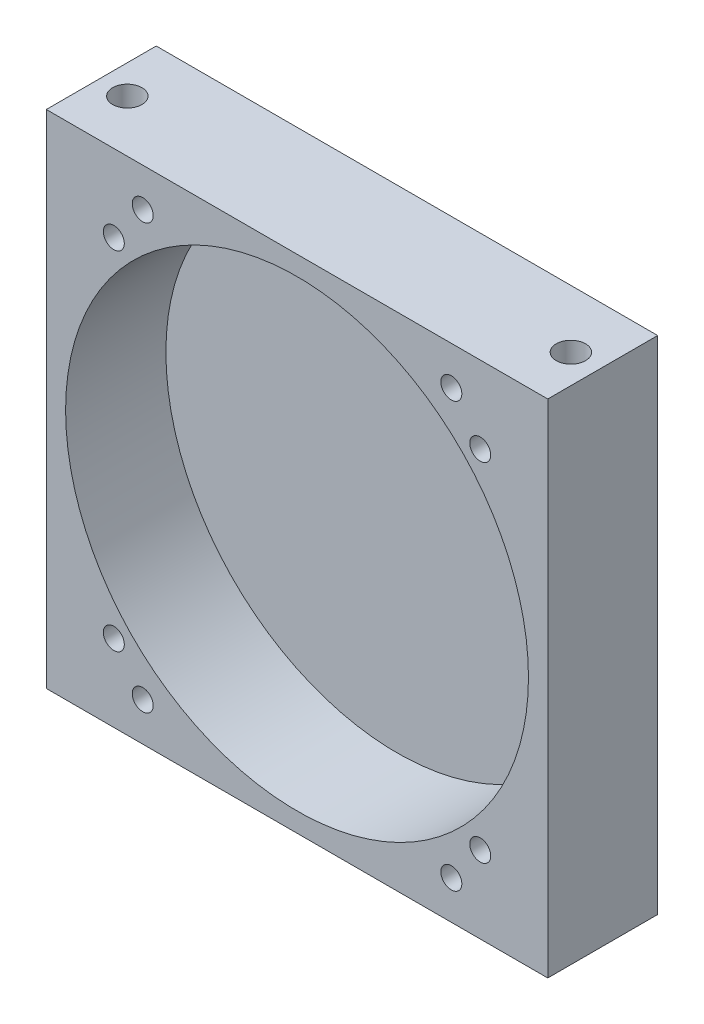
ISO-10303-21;
HEADER;
FILE_DESCRIPTION(('STEP AP214'),'2;1');
FILE_NAME('part.step','',(''),(''),'','','');
FILE_SCHEMA(('AUTOMOTIVE_DESIGN { 1 0 10303 214 1 1 1 1 }'));
ENDSEC;
DATA;
#1=APPLICATION_CONTEXT('core data for automotive mechanical design processes');
#2=APPLICATION_PROTOCOL_DEFINITION('international standard','automotive_design',2000,#1);
#3=PRODUCT_CONTEXT('',#1,'mechanical');
#4=PRODUCT('Part','Part','',(#3));
#5=PRODUCT_RELATED_PRODUCT_CATEGORY('part','',(#4));
#6=PRODUCT_DEFINITION_FORMATION('','',#4);
#7=PRODUCT_DEFINITION_CONTEXT('part definition',#1,'design');
#8=PRODUCT_DEFINITION('design','',#6,#7);
#9=PRODUCT_DEFINITION_SHAPE('','',#8);
#10=(LENGTH_UNIT() NAMED_UNIT(*) SI_UNIT(.MILLI.,.METRE.));
#11=(NAMED_UNIT(*) PLANE_ANGLE_UNIT() SI_UNIT($,.RADIAN.));
#12=(NAMED_UNIT(*) SI_UNIT($,.STERADIAN.) SOLID_ANGLE_UNIT());
#13=UNCERTAINTY_MEASURE_WITH_UNIT(LENGTH_MEASURE(1.E-05),#10,'distance_accuracy_value','');
#14=(GEOMETRIC_REPRESENTATION_CONTEXT(3) GLOBAL_UNCERTAINTY_ASSIGNED_CONTEXT((#13)) GLOBAL_UNIT_ASSIGNED_CONTEXT((#10,
#11,#12)) REPRESENTATION_CONTEXT('',''));
#15=CARTESIAN_POINT('',(0.,0.,0.));
#16=DIRECTION('',(0.,0.,1.));
#17=DIRECTION('',(1.,0.,0.));
#18=AXIS2_PLACEMENT_3D('',#15,#16,#17);
#19=CARTESIAN_POINT('',(-41.275,-41.275,18.0975));
#20=DIRECTION('',(1.,0.,0.));
#21=DIRECTION('',(0.,0.,-1.));
#22=AXIS2_PLACEMENT_3D('',#19,#20,#21);
#23=PLANE('',#22);
#24=DIRECTION('',(0.,-1.,0.));
#25=VECTOR('',#24,1.);
#26=CARTESIAN_POINT('',(-41.275,-41.275,0.));
#27=LINE('',#26,#25);
#28=CARTESIAN_POINT('',(-41.275,41.275,0.));
#29=VERTEX_POINT('',#28);
#30=CARTESIAN_POINT('',(-41.275,-41.275,0.));
#31=VERTEX_POINT('',#30);
#32=EDGE_CURVE('E236',#29,#31,#27,.T.);
#33=ORIENTED_EDGE('',*,*,#32,.T.);
#34=DIRECTION('',(0.,0.,-1.));
#35=VECTOR('',#34,1.);
#36=CARTESIAN_POINT('',(-41.275,-41.275,18.0975));
#37=LINE('',#36,#35);
#38=CARTESIAN_POINT('',(-41.275,-41.275,18.0975));
#39=VERTEX_POINT('',#38);
#40=EDGE_CURVE('E11',#39,#31,#37,.T.);
#41=ORIENTED_EDGE('',*,*,#40,.F.);
#42=DIRECTION('',(0.,-1.,0.));
#43=VECTOR('',#42,1.);
#44=CARTESIAN_POINT('',(-41.275,-41.275,18.0975));
#45=LINE('',#44,#43);
#46=CARTESIAN_POINT('',(-41.275,41.275,18.0975));
#47=VERTEX_POINT('',#46);
#48=EDGE_CURVE('E239',#47,#39,#45,.T.);
#49=ORIENTED_EDGE('',*,*,#48,.F.);
#50=DIRECTION('',(0.,0.,-1.));
#51=VECTOR('',#50,1.);
#52=CARTESIAN_POINT('',(-41.275,41.275,18.0975));
#53=LINE('',#52,#51);
#54=EDGE_CURVE('E245',#47,#29,#53,.T.);
#55=ORIENTED_EDGE('',*,*,#54,.T.);
#56=EDGE_LOOP('',(#33,#41,#49,#55));
#57=FACE_BOUND('',#56,.T.);
#58=ADVANCED_FACE('F43',(#57),#23,.F.);
#59=CARTESIAN_POINT('',(41.275,-41.275,18.0975));
#60=DIRECTION('',(0.,1.,0.));
#61=DIRECTION('',(-1.,0.,0.));
#62=AXIS2_PLACEMENT_3D('',#59,#60,#61);
#63=PLANE('',#62);
#64=CARTESIAN_POINT('',(-36.5125,-41.275,9.525));
#65=DIRECTION('',(0.,-1.,0.));
#66=DIRECTION('',(0.,0.,-1.));
#67=AXIS2_PLACEMENT_3D('',#64,#65,#66);
#68=CIRCLE('',#67,2.413);
#69=CARTESIAN_POINT('',(-36.5125,-41.275,7.112));
#70=VERTEX_POINT('',#69);
#71=EDGE_CURVE('E184',#70,#70,#68,.T.);
#72=ORIENTED_EDGE('',*,*,#71,.F.);
#73=EDGE_LOOP('',(#72));
#74=FACE_BOUND('',#73,.T.);
#75=CARTESIAN_POINT('',(36.5125,-41.275,9.525));
#76=DIRECTION('',(0.,-1.,0.));
#77=DIRECTION('',(0.,0.,-1.));
#78=AXIS2_PLACEMENT_3D('',#75,#76,#77);
#79=CIRCLE('',#78,2.413);
#80=CARTESIAN_POINT('',(36.5125,-41.275,7.112));
#81=VERTEX_POINT('',#80);
#82=EDGE_CURVE('E196',#81,#81,#79,.T.);
#83=ORIENTED_EDGE('',*,*,#82,.F.);
#84=EDGE_LOOP('',(#83));
#85=FACE_BOUND('',#84,.T.);
#86=DIRECTION('',(1.,0.,0.));
#87=VECTOR('',#86,1.);
#88=CARTESIAN_POINT('',(41.275,-41.275,0.));
#89=LINE('',#88,#87);
#90=CARTESIAN_POINT('',(41.275,-41.275,0.));
#91=VERTEX_POINT('',#90);
#92=EDGE_CURVE('E248',#31,#91,#89,.T.);
#93=ORIENTED_EDGE('',*,*,#92,.T.);
#94=DIRECTION('',(0.,0.,-1.));
#95=VECTOR('',#94,1.);
#96=CARTESIAN_POINT('',(41.275,-41.275,18.0975));
#97=LINE('',#96,#95);
#98=CARTESIAN_POINT('',(41.275,-41.275,18.0975));
#99=VERTEX_POINT('',#98);
#100=EDGE_CURVE('E51',#99,#91,#97,.T.);
#101=ORIENTED_EDGE('',*,*,#100,.F.);
#102=DIRECTION('',(1.,0.,0.));
#103=VECTOR('',#102,1.);
#104=CARTESIAN_POINT('',(41.275,-41.275,18.0975));
#105=LINE('',#104,#103);
#106=EDGE_CURVE('E90',#39,#99,#105,.T.);
#107=ORIENTED_EDGE('',*,*,#106,.F.);
#108=ORIENTED_EDGE('',*,*,#40,.T.);
#109=EDGE_LOOP('',(#93,#101,#107,#108));
#110=FACE_BOUND('',#109,.T.);
#111=ADVANCED_FACE('F273',(#74,#85,#110),#63,.F.);
#112=CARTESIAN_POINT('',(41.275,-41.275,18.0975));
#113=DIRECTION('',(-1.,0.,0.));
#114=DIRECTION('',(0.,0.,1.));
#115=AXIS2_PLACEMENT_3D('',#112,#113,#114);
#116=PLANE('',#115);
#117=DIRECTION('',(0.,1.,0.));
#118=VECTOR('',#117,1.);
#119=CARTESIAN_POINT('',(41.275,-41.275,0.));
#120=LINE('',#119,#118);
#121=CARTESIAN_POINT('',(41.275,41.275,0.));
#122=VERTEX_POINT('',#121);
#123=EDGE_CURVE('E77',#91,#122,#120,.T.);
#124=ORIENTED_EDGE('',*,*,#123,.T.);
#125=DIRECTION('',(0.,0.,-1.));
#126=VECTOR('',#125,1.);
#127=CARTESIAN_POINT('',(41.275,41.275,18.0975));
#128=LINE('',#127,#126);
#129=CARTESIAN_POINT('',(41.275,41.275,18.0975));
#130=VERTEX_POINT('',#129);
#131=EDGE_CURVE('E253',#130,#122,#128,.T.);
#132=ORIENTED_EDGE('',*,*,#131,.F.);
#133=DIRECTION('',(0.,1.,0.));
#134=VECTOR('',#133,1.);
#135=CARTESIAN_POINT('',(41.275,-41.275,18.0975));
#136=LINE('',#135,#134);
#137=EDGE_CURVE('E242',#99,#130,#136,.T.);
#138=ORIENTED_EDGE('',*,*,#137,.F.);
#139=ORIENTED_EDGE('',*,*,#100,.T.);
#140=EDGE_LOOP('',(#124,#132,#138,#139));
#141=FACE_BOUND('',#140,.T.);
#142=ADVANCED_FACE('F255',(#141),#116,.F.);
#143=CARTESIAN_POINT('',(41.275,41.275,18.0975));
#144=DIRECTION('',(0.,-1.,0.));
#145=DIRECTION('',(1.,0.,0.));
#146=AXIS2_PLACEMENT_3D('',#143,#144,#145);
#147=PLANE('',#146);
#148=CARTESIAN_POINT('',(-36.5125,41.275,9.525));
#149=DIRECTION('',(0.,1.,0.));
#150=DIRECTION('',(0.,0.,1.));
#151=AXIS2_PLACEMENT_3D('',#148,#149,#150);
#152=CIRCLE('',#151,2.413);
#153=CARTESIAN_POINT('',(-36.5125,41.275,11.938));
#154=VERTEX_POINT('',#153);
#155=EDGE_CURVE('E208',#154,#154,#152,.T.);
#156=ORIENTED_EDGE('',*,*,#155,.F.);
#157=EDGE_LOOP('',(#156));
#158=FACE_BOUND('',#157,.T.);
#159=CARTESIAN_POINT('',(36.5125,41.275,9.525));
#160=DIRECTION('',(0.,1.,0.));
#161=DIRECTION('',(0.,0.,1.));
#162=AXIS2_PLACEMENT_3D('',#159,#160,#161);
#163=CIRCLE('',#162,2.413);
#164=CARTESIAN_POINT('',(36.5125,41.275,11.938));
#165=VERTEX_POINT('',#164);
#166=EDGE_CURVE('E220',#165,#165,#163,.T.);
#167=ORIENTED_EDGE('',*,*,#166,.F.);
#168=EDGE_LOOP('',(#167));
#169=FACE_BOUND('',#168,.T.);
#170=DIRECTION('',(-1.,0.,0.));
#171=VECTOR('',#170,1.);
#172=CARTESIAN_POINT('',(41.275,41.275,0.));
#173=LINE('',#172,#171);
#174=EDGE_CURVE('E83',#122,#29,#173,.T.);
#175=ORIENTED_EDGE('',*,*,#174,.T.);
#176=ORIENTED_EDGE('',*,*,#54,.F.);
#177=DIRECTION('',(-1.,0.,0.));
#178=VECTOR('',#177,1.);
#179=CARTESIAN_POINT('',(41.275,41.275,18.0975));
#180=LINE('',#179,#178);
#181=EDGE_CURVE('E59',#130,#47,#180,.T.);
#182=ORIENTED_EDGE('',*,*,#181,.F.);
#183=ORIENTED_EDGE('',*,*,#131,.T.);
#184=EDGE_LOOP('',(#175,#176,#182,#183));
#185=FACE_BOUND('',#184,.T.);
#186=ADVANCED_FACE('F262',(#158,#169,#185),#147,.F.);
#187=CARTESIAN_POINT('',(-41.275,41.275,18.0975));
#188=DIRECTION('',(0.,0.,1.));
#189=DIRECTION('',(1.,0.,0.));
#190=AXIS2_PLACEMENT_3D('',#187,#188,#189);
#191=PLANE('',#190);
#192=CARTESIAN_POINT('',(30.1625,-28.575,18.0975));
#193=DIRECTION('',(0.,0.,1.));
#194=DIRECTION('',(1.,0.,0.));
#195=AXIS2_PLACEMENT_3D('',#192,#193,#194);
#196=CIRCLE('',#195,1.72719999999999);
#197=CARTESIAN_POINT('',(31.8897,-28.575,18.0975));
#198=VERTEX_POINT('',#197);
#199=EDGE_CURVE('E138',#198,#198,#196,.T.);
#200=ORIENTED_EDGE('',*,*,#199,.F.);
#201=EDGE_LOOP('',(#200));
#202=FACE_BOUND('',#201,.T.);
#203=CARTESIAN_POINT('',(-30.1625,28.575,18.0975));
#204=DIRECTION('',(0.,0.,1.));
#205=DIRECTION('',(1.,0.,0.));
#206=AXIS2_PLACEMENT_3D('',#203,#204,#205);
#207=CIRCLE('',#206,1.72719999999999);
#208=CARTESIAN_POINT('',(-28.4353,28.575,18.0975));
#209=VERTEX_POINT('',#208);
#210=EDGE_CURVE('E137',#209,#209,#207,.T.);
#211=ORIENTED_EDGE('',*,*,#210,.F.);
#212=EDGE_LOOP('',(#211));
#213=FACE_BOUND('',#212,.T.);
#214=CARTESIAN_POINT('',(-30.1625,-28.575,18.0975));
#215=DIRECTION('',(0.,0.,1.));
#216=DIRECTION('',(1.,0.,0.));
#217=AXIS2_PLACEMENT_3D('',#214,#215,#216);
#218=CIRCLE('',#217,1.72719999999999);
#219=CARTESIAN_POINT('',(-28.4353,-28.575,18.0975));
#220=VERTEX_POINT('',#219);
#221=EDGE_CURVE('E148',#220,#220,#218,.T.);
#222=ORIENTED_EDGE('',*,*,#221,.F.);
#223=EDGE_LOOP('',(#222));
#224=FACE_BOUND('',#223,.T.);
#225=CARTESIAN_POINT('',(30.1625,28.575,18.0975));
#226=DIRECTION('',(0.,0.,1.));
#227=DIRECTION('',(1.,0.,0.));
#228=AXIS2_PLACEMENT_3D('',#225,#226,#227);
#229=CIRCLE('',#228,1.72719999999999);
#230=CARTESIAN_POINT('',(31.8897,28.575,18.0975));
#231=VERTEX_POINT('',#230);
#232=EDGE_CURVE('E154',#231,#231,#229,.T.);
#233=ORIENTED_EDGE('',*,*,#232,.F.);
#234=EDGE_LOOP('',(#233));
#235=FACE_BOUND('',#234,.T.);
#236=CARTESIAN_POINT('',(25.4,-34.925,18.0975));
#237=DIRECTION('',(0.,0.,1.));
#238=DIRECTION('',(1.,0.,0.));
#239=AXIS2_PLACEMENT_3D('',#236,#237,#238);
#240=CIRCLE('',#239,1.72719999999999);
#241=CARTESIAN_POINT('',(27.1272,-34.925,18.0975));
#242=VERTEX_POINT('',#241);
#243=EDGE_CURVE('E160',#242,#242,#240,.T.);
#244=ORIENTED_EDGE('',*,*,#243,.F.);
#245=EDGE_LOOP('',(#244));
#246=FACE_BOUND('',#245,.T.);
#247=CARTESIAN_POINT('',(-25.4,-34.925,18.0975));
#248=DIRECTION('',(0.,0.,1.));
#249=DIRECTION('',(1.,0.,0.));
#250=AXIS2_PLACEMENT_3D('',#247,#248,#249);
#251=CIRCLE('',#250,1.72719999999999);
#252=CARTESIAN_POINT('',(-23.6728,-34.925,18.0975));
#253=VERTEX_POINT('',#252);
#254=EDGE_CURVE('E166',#253,#253,#251,.T.);
#255=ORIENTED_EDGE('',*,*,#254,.F.);
#256=EDGE_LOOP('',(#255));
#257=FACE_BOUND('',#256,.T.);
#258=CARTESIAN_POINT('',(-25.4,34.925,18.0975));
#259=DIRECTION('',(0.,0.,1.));
#260=DIRECTION('',(1.,0.,0.));
#261=AXIS2_PLACEMENT_3D('',#258,#259,#260);
#262=CIRCLE('',#261,1.72719999999999);
#263=CARTESIAN_POINT('',(-23.6728,34.925,18.0975));
#264=VERTEX_POINT('',#263);
#265=EDGE_CURVE('E172',#264,#264,#262,.T.);
#266=ORIENTED_EDGE('',*,*,#265,.F.);
#267=EDGE_LOOP('',(#266));
#268=FACE_BOUND('',#267,.T.);
#269=CARTESIAN_POINT('',(25.4,34.925,18.0975));
#270=DIRECTION('',(0.,0.,1.));
#271=DIRECTION('',(1.,0.,0.));
#272=AXIS2_PLACEMENT_3D('',#269,#270,#271);
#273=CIRCLE('',#272,1.72719999999999);
#274=CARTESIAN_POINT('',(27.1272,34.925,18.0975));
#275=VERTEX_POINT('',#274);
#276=EDGE_CURVE('E178',#275,#275,#273,.T.);
#277=ORIENTED_EDGE('',*,*,#276,.F.);
#278=EDGE_LOOP('',(#277));
#279=FACE_BOUND('',#278,.T.);
#280=CARTESIAN_POINT('',(0.,0.,18.0975));
#281=DIRECTION('',(0.,0.,1.));
#282=DIRECTION('',(1.,0.,0.));
#283=AXIS2_PLACEMENT_3D('',#280,#281,#282);
#284=CIRCLE('',#283,38.1);
#285=CARTESIAN_POINT('',(38.1,0.,18.0975));
#286=VERTEX_POINT('',#285);
#287=EDGE_CURVE('E232',#286,#286,#284,.T.);
#288=ORIENTED_EDGE('',*,*,#287,.F.);
#289=EDGE_LOOP('',(#288));
#290=FACE_BOUND('',#289,.T.);
#291=ORIENTED_EDGE('',*,*,#48,.T.);
#292=ORIENTED_EDGE('',*,*,#106,.T.);
#293=ORIENTED_EDGE('',*,*,#137,.T.);
#294=ORIENTED_EDGE('',*,*,#181,.T.);
#295=EDGE_LOOP('',(#291,#292,#293,#294));
#296=FACE_BOUND('',#295,.T.);
#297=ADVANCED_FACE('F264',(#202,#213,#224,#235,#246,#257,#268,#279,#290,#296),#191,.T.);
#298=CARTESIAN_POINT('',(-41.275,41.275,0.));
#299=DIRECTION('',(0.,0.,1.));
#300=DIRECTION('',(1.,0.,0.));
#301=AXIS2_PLACEMENT_3D('',#298,#299,#300);
#302=PLANE('',#301);
#303=ORIENTED_EDGE('',*,*,#32,.F.);
#304=ORIENTED_EDGE('',*,*,#174,.F.);
#305=ORIENTED_EDGE('',*,*,#123,.F.);
#306=ORIENTED_EDGE('',*,*,#92,.F.);
#307=EDGE_LOOP('',(#303,#304,#305,#306));
#308=FACE_BOUND('',#307,.T.);
#309=ADVANCED_FACE('F258',(#308),#302,.F.);
#310=CARTESIAN_POINT('',(0.,0.,1.5875));
#311=DIRECTION('',(0.,0.,1.));
#312=DIRECTION('',(1.,0.,0.));
#313=AXIS2_PLACEMENT_3D('',#310,#311,#312);
#314=CYLINDRICAL_SURFACE('',#313,38.1);
#315=CARTESIAN_POINT('',(0.,0.,1.5875));
#316=DIRECTION('',(0.,0.,1.));
#317=DIRECTION('',(1.,0.,0.));
#318=AXIS2_PLACEMENT_3D('',#315,#316,#317);
#319=CIRCLE('',#318,38.1);
#320=CARTESIAN_POINT('',(38.1,0.,1.5875));
#321=VERTEX_POINT('',#320);
#322=EDGE_CURVE('E233',#321,#321,#319,.T.);
#323=ORIENTED_EDGE('',*,*,#322,.F.);
#324=EDGE_LOOP('',(#323));
#325=FACE_BOUND('',#324,.T.);
#326=ORIENTED_EDGE('',*,*,#287,.T.);
#327=EDGE_LOOP('',(#326));
#328=FACE_BOUND('',#327,.T.);
#329=ADVANCED_FACE('F350',(#325,#328),#314,.F.);
#330=CARTESIAN_POINT('',(0.,0.,1.5875));
#331=DIRECTION('',(0.,0.,1.));
#332=DIRECTION('',(1.,0.,0.));
#333=AXIS2_PLACEMENT_3D('',#330,#331,#332);
#334=PLANE('',#333);
#335=ORIENTED_EDGE('',*,*,#322,.T.);
#336=EDGE_LOOP('',(#335));
#337=FACE_BOUND('',#336,.T.);
#338=ADVANCED_FACE('F346',(#337),#334,.T.);
#339=CARTESIAN_POINT('',(36.5125,22.225,9.525));
#340=DIRECTION('',(0.,1.,0.));
#341=DIRECTION('',(0.,0.,1.));
#342=AXIS2_PLACEMENT_3D('',#339,#340,#341);
#343=CONICAL_SURFACE('',#342,2.01929999999999,1.02974425867665);
#344=CARTESIAN_POINT('',(36.5125,21.0116821519976,9.525));
#345=VERTEX_POINT('',#344);
#346=VERTEX_LOOP('',#345);
#347=FACE_BOUND('',#346,.T.);
#348=CARTESIAN_POINT('',(36.5125,22.225,9.525));
#349=DIRECTION('',(0.,1.,0.));
#350=DIRECTION('',(0.,0.,1.));
#351=AXIS2_PLACEMENT_3D('',#348,#349,#350);
#352=CIRCLE('',#351,2.01929999999999);
#353=CARTESIAN_POINT('',(36.5125,22.225,11.5443));
#354=VERTEX_POINT('',#353);
#355=EDGE_CURVE('E229',#354,#354,#352,.T.);
#356=ORIENTED_EDGE('',*,*,#355,.T.);
#357=EDGE_LOOP('',(#356));
#358=FACE_BOUND('',#357,.T.);
#359=ADVANCED_FACE('F342',(#347,#358),#343,.F.);
#360=CARTESIAN_POINT('',(36.5125,41.275,9.525));
#361=DIRECTION('',(0.,1.,0.));
#362=DIRECTION('',(0.,0.,1.));
#363=AXIS2_PLACEMENT_3D('',#360,#361,#362);
#364=CYLINDRICAL_SURFACE('',#363,2.01929999999999);
#365=ORIENTED_EDGE('',*,*,#355,.F.);
#366=EDGE_LOOP('',(#365));
#367=FACE_BOUND('',#366,.T.);
#368=CARTESIAN_POINT('',(36.5125,22.987,9.525));
#369=DIRECTION('',(0.,1.,0.));
#370=DIRECTION('',(0.,0.,1.));
#371=AXIS2_PLACEMENT_3D('',#368,#369,#370);
#372=CIRCLE('',#371,2.01929999999999);
#373=CARTESIAN_POINT('',(36.5125,22.987,11.5443));
#374=VERTEX_POINT('',#373);
#375=EDGE_CURVE('E226',#374,#374,#372,.T.);
#376=ORIENTED_EDGE('',*,*,#375,.T.);
#377=EDGE_LOOP('',(#376));
#378=FACE_BOUND('',#377,.T.);
#379=ADVANCED_FACE('F338',(#367,#378),#364,.F.);
#380=CARTESIAN_POINT('',(38.5318,22.987,9.525));
#381=DIRECTION('',(0.,-1.,0.));
#382=DIRECTION('',(0.,0.,-1.));
#383=AXIS2_PLACEMENT_3D('',#380,#381,#382);
#384=PLANE('',#383);
#385=ORIENTED_EDGE('',*,*,#375,.F.);
#386=EDGE_LOOP('',(#385));
#387=FACE_BOUND('',#386,.T.);
#388=CARTESIAN_POINT('',(36.5125,22.987,9.525));
#389=DIRECTION('',(0.,1.,0.));
#390=DIRECTION('',(0.,0.,1.));
#391=AXIS2_PLACEMENT_3D('',#388,#389,#390);
#392=CIRCLE('',#391,2.413);
#393=CARTESIAN_POINT('',(36.5125,22.987,11.938));
#394=VERTEX_POINT('',#393);
#395=EDGE_CURVE('E223',#394,#394,#392,.T.);
#396=ORIENTED_EDGE('',*,*,#395,.T.);
#397=EDGE_LOOP('',(#396));
#398=FACE_BOUND('',#397,.T.);
#399=ADVANCED_FACE('F334',(#387,#398),#384,.F.);
#400=CARTESIAN_POINT('',(36.5125,41.275,9.525));
#401=DIRECTION('',(0.,1.,0.));
#402=DIRECTION('',(0.,0.,1.));
#403=AXIS2_PLACEMENT_3D('',#400,#401,#402);
#404=CYLINDRICAL_SURFACE('',#403,2.413);
#405=ORIENTED_EDGE('',*,*,#395,.F.);
#406=EDGE_LOOP('',(#405));
#407=FACE_BOUND('',#406,.T.);
#408=ORIENTED_EDGE('',*,*,#166,.T.);
#409=EDGE_LOOP('',(#408));
#410=FACE_BOUND('',#409,.T.);
#411=ADVANCED_FACE('F330',(#407,#410),#404,.F.);
#412=CARTESIAN_POINT('',(-36.5125,22.225,9.525));
#413=DIRECTION('',(0.,1.,0.));
#414=DIRECTION('',(0.,0.,1.));
#415=AXIS2_PLACEMENT_3D('',#412,#413,#414);
#416=CONICAL_SURFACE('',#415,2.01929999999999,1.02974425867665);
#417=CARTESIAN_POINT('',(-36.5125,21.0116821519976,9.525));
#418=VERTEX_POINT('',#417);
#419=VERTEX_LOOP('',#418);
#420=FACE_BOUND('',#419,.T.);
#421=CARTESIAN_POINT('',(-36.5125,22.225,9.525));
#422=DIRECTION('',(0.,1.,0.));
#423=DIRECTION('',(0.,0.,1.));
#424=AXIS2_PLACEMENT_3D('',#421,#422,#423);
#425=CIRCLE('',#424,2.01929999999999);
#426=CARTESIAN_POINT('',(-36.5125,22.225,11.5443));
#427=VERTEX_POINT('',#426);
#428=EDGE_CURVE('E217',#427,#427,#425,.T.);
#429=ORIENTED_EDGE('',*,*,#428,.T.);
#430=EDGE_LOOP('',(#429));
#431=FACE_BOUND('',#430,.T.);
#432=ADVANCED_FACE('F326',(#420,#431),#416,.F.);
#433=CARTESIAN_POINT('',(-36.5125,41.275,9.525));
#434=DIRECTION('',(0.,1.,0.));
#435=DIRECTION('',(0.,0.,1.));
#436=AXIS2_PLACEMENT_3D('',#433,#434,#435);
#437=CYLINDRICAL_SURFACE('',#436,2.01929999999999);
#438=ORIENTED_EDGE('',*,*,#428,.F.);
#439=EDGE_LOOP('',(#438));
#440=FACE_BOUND('',#439,.T.);
#441=CARTESIAN_POINT('',(-36.5125,22.987,9.525));
#442=DIRECTION('',(0.,1.,0.));
#443=DIRECTION('',(0.,0.,1.));
#444=AXIS2_PLACEMENT_3D('',#441,#442,#443);
#445=CIRCLE('',#444,2.01929999999999);
#446=CARTESIAN_POINT('',(-36.5125,22.987,11.5443));
#447=VERTEX_POINT('',#446);
#448=EDGE_CURVE('E214',#447,#447,#445,.T.);
#449=ORIENTED_EDGE('',*,*,#448,.T.);
#450=EDGE_LOOP('',(#449));
#451=FACE_BOUND('',#450,.T.);
#452=ADVANCED_FACE('F322',(#440,#451),#437,.F.);
#453=CARTESIAN_POINT('',(-34.4932,22.987,9.525));
#454=DIRECTION('',(0.,-1.,0.));
#455=DIRECTION('',(0.,0.,-1.));
#456=AXIS2_PLACEMENT_3D('',#453,#454,#455);
#457=PLANE('',#456);
#458=ORIENTED_EDGE('',*,*,#448,.F.);
#459=EDGE_LOOP('',(#458));
#460=FACE_BOUND('',#459,.T.);
#461=CARTESIAN_POINT('',(-36.5125,22.987,9.525));
#462=DIRECTION('',(0.,1.,0.));
#463=DIRECTION('',(0.,0.,1.));
#464=AXIS2_PLACEMENT_3D('',#461,#462,#463);
#465=CIRCLE('',#464,2.413);
#466=CARTESIAN_POINT('',(-36.5125,22.987,11.938));
#467=VERTEX_POINT('',#466);
#468=EDGE_CURVE('E211',#467,#467,#465,.T.);
#469=ORIENTED_EDGE('',*,*,#468,.T.);
#470=EDGE_LOOP('',(#469));
#471=FACE_BOUND('',#470,.T.);
#472=ADVANCED_FACE('F318',(#460,#471),#457,.F.);
#473=CARTESIAN_POINT('',(-36.5125,41.275,9.525));
#474=DIRECTION('',(0.,1.,0.));
#475=DIRECTION('',(0.,0.,1.));
#476=AXIS2_PLACEMENT_3D('',#473,#474,#475);
#477=CYLINDRICAL_SURFACE('',#476,2.413);
#478=ORIENTED_EDGE('',*,*,#468,.F.);
#479=EDGE_LOOP('',(#478));
#480=FACE_BOUND('',#479,.T.);
#481=ORIENTED_EDGE('',*,*,#155,.T.);
#482=EDGE_LOOP('',(#481));
#483=FACE_BOUND('',#482,.T.);
#484=ADVANCED_FACE('F314',(#480,#483),#477,.F.);
#485=CARTESIAN_POINT('',(36.5125,-22.225,9.525));
#486=DIRECTION('',(0.,-1.,0.));
#487=DIRECTION('',(0.,0.,-1.));
#488=AXIS2_PLACEMENT_3D('',#485,#486,#487);
#489=CONICAL_SURFACE('',#488,2.01929999999999,1.02974425867665);
#490=CARTESIAN_POINT('',(36.5125,-21.0116821519976,9.525));
#491=VERTEX_POINT('',#490);
#492=VERTEX_LOOP('',#491);
#493=FACE_BOUND('',#492,.T.);
#494=CARTESIAN_POINT('',(36.5125,-22.225,9.525));
#495=DIRECTION('',(0.,-1.,0.));
#496=DIRECTION('',(0.,0.,-1.));
#497=AXIS2_PLACEMENT_3D('',#494,#495,#496);
#498=CIRCLE('',#497,2.01929999999999);
#499=CARTESIAN_POINT('',(36.5125,-22.225,7.50570000000001));
#500=VERTEX_POINT('',#499);
#501=EDGE_CURVE('E205',#500,#500,#498,.T.);
#502=ORIENTED_EDGE('',*,*,#501,.T.);
#503=EDGE_LOOP('',(#502));
#504=FACE_BOUND('',#503,.T.);
#505=ADVANCED_FACE('F310',(#493,#504),#489,.F.);
#506=CARTESIAN_POINT('',(36.5125,-41.275,9.525));
#507=DIRECTION('',(0.,-1.,0.));
#508=DIRECTION('',(0.,0.,-1.));
#509=AXIS2_PLACEMENT_3D('',#506,#507,#508);
#510=CYLINDRICAL_SURFACE('',#509,2.01929999999999);
#511=ORIENTED_EDGE('',*,*,#501,.F.);
#512=EDGE_LOOP('',(#511));
#513=FACE_BOUND('',#512,.T.);
#514=CARTESIAN_POINT('',(36.5125,-22.987,9.525));
#515=DIRECTION('',(0.,-1.,0.));
#516=DIRECTION('',(0.,0.,-1.));
#517=AXIS2_PLACEMENT_3D('',#514,#515,#516);
#518=CIRCLE('',#517,2.01929999999999);
#519=CARTESIAN_POINT('',(36.5125,-22.987,7.50570000000001));
#520=VERTEX_POINT('',#519);
#521=EDGE_CURVE('E202',#520,#520,#518,.T.);
#522=ORIENTED_EDGE('',*,*,#521,.T.);
#523=EDGE_LOOP('',(#522));
#524=FACE_BOUND('',#523,.T.);
#525=ADVANCED_FACE('F302',(#513,#524),#510,.F.);
#526=CARTESIAN_POINT('',(38.5318,-22.987,9.525));
#527=DIRECTION('',(0.,1.,0.));
#528=DIRECTION('',(0.,0.,1.));
#529=AXIS2_PLACEMENT_3D('',#526,#527,#528);
#530=PLANE('',#529);
#531=ORIENTED_EDGE('',*,*,#521,.F.);
#532=EDGE_LOOP('',(#531));
#533=FACE_BOUND('',#532,.T.);
#534=CARTESIAN_POINT('',(36.5125,-22.987,9.525));
#535=DIRECTION('',(0.,-1.,0.));
#536=DIRECTION('',(0.,0.,-1.));
#537=AXIS2_PLACEMENT_3D('',#534,#535,#536);
#538=CIRCLE('',#537,2.413);
#539=CARTESIAN_POINT('',(36.5125,-22.987,7.112));
#540=VERTEX_POINT('',#539);
#541=EDGE_CURVE('E199',#540,#540,#538,.T.);
#542=ORIENTED_EDGE('',*,*,#541,.T.);
#543=EDGE_LOOP('',(#542));
#544=FACE_BOUND('',#543,.T.);
#545=ADVANCED_FACE('F292',(#533,#544),#530,.F.);
#546=CARTESIAN_POINT('',(36.5125,-41.275,9.525));
#547=DIRECTION('',(0.,-1.,0.));
#548=DIRECTION('',(0.,0.,-1.));
#549=AXIS2_PLACEMENT_3D('',#546,#547,#548);
#550=CYLINDRICAL_SURFACE('',#549,2.413);
#551=ORIENTED_EDGE('',*,*,#541,.F.);
#552=EDGE_LOOP('',(#551));
#553=FACE_BOUND('',#552,.T.);
#554=ORIENTED_EDGE('',*,*,#82,.T.);
#555=EDGE_LOOP('',(#554));
#556=FACE_BOUND('',#555,.T.);
#557=ADVANCED_FACE('F289',(#553,#556),#550,.F.);
#558=CARTESIAN_POINT('',(-36.5125,-22.225,9.525));
#559=DIRECTION('',(0.,-1.,0.));
#560=DIRECTION('',(0.,0.,-1.));
#561=AXIS2_PLACEMENT_3D('',#558,#559,#560);
#562=CONICAL_SURFACE('',#561,2.01929999999999,1.02974425867665);
#563=CARTESIAN_POINT('',(-36.5125,-21.0116821519976,9.525));
#564=VERTEX_POINT('',#563);
#565=VERTEX_LOOP('',#564);
#566=FACE_BOUND('',#565,.T.);
#567=CARTESIAN_POINT('',(-36.5125,-22.225,9.525));
#568=DIRECTION('',(0.,-1.,0.));
#569=DIRECTION('',(0.,0.,-1.));
#570=AXIS2_PLACEMENT_3D('',#567,#568,#569);
#571=CIRCLE('',#570,2.01929999999999);
#572=CARTESIAN_POINT('',(-36.5125,-22.225,7.50570000000001));
#573=VERTEX_POINT('',#572);
#574=EDGE_CURVE('E193',#573,#573,#571,.T.);
#575=ORIENTED_EDGE('',*,*,#574,.T.);
#576=EDGE_LOOP('',(#575));
#577=FACE_BOUND('',#576,.T.);
#578=ADVANCED_FACE('F291',(#566,#577),#562,.F.);
#579=CARTESIAN_POINT('',(-36.5125,-41.275,9.525));
#580=DIRECTION('',(0.,-1.,0.));
#581=DIRECTION('',(0.,0.,-1.));
#582=AXIS2_PLACEMENT_3D('',#579,#580,#581);
#583=CYLINDRICAL_SURFACE('',#582,2.01929999999999);
#584=ORIENTED_EDGE('',*,*,#574,.F.);
#585=EDGE_LOOP('',(#584));
#586=FACE_BOUND('',#585,.T.);
#587=CARTESIAN_POINT('',(-36.5125,-22.987,9.525));
#588=DIRECTION('',(0.,-1.,0.));
#589=DIRECTION('',(0.,0.,-1.));
#590=AXIS2_PLACEMENT_3D('',#587,#588,#589);
#591=CIRCLE('',#590,2.01929999999999);
#592=CARTESIAN_POINT('',(-36.5125,-22.987,7.50570000000001));
#593=VERTEX_POINT('',#592);
#594=EDGE_CURVE('E190',#593,#593,#591,.T.);
#595=ORIENTED_EDGE('',*,*,#594,.T.);
#596=EDGE_LOOP('',(#595));
#597=FACE_BOUND('',#596,.T.);
#598=ADVANCED_FACE('F299',(#586,#597),#583,.F.);
#599=CARTESIAN_POINT('',(-34.4932,-22.987,9.525));
#600=DIRECTION('',(0.,1.,0.));
#601=DIRECTION('',(0.,0.,1.));
#602=AXIS2_PLACEMENT_3D('',#599,#600,#601);
#603=PLANE('',#602);
#604=ORIENTED_EDGE('',*,*,#594,.F.);
#605=EDGE_LOOP('',(#604));
#606=FACE_BOUND('',#605,.T.);
#607=CARTESIAN_POINT('',(-36.5125,-22.987,9.525));
#608=DIRECTION('',(0.,-1.,0.));
#609=DIRECTION('',(0.,0.,-1.));
#610=AXIS2_PLACEMENT_3D('',#607,#608,#609);
#611=CIRCLE('',#610,2.413);
#612=CARTESIAN_POINT('',(-36.5125,-22.987,7.112));
#613=VERTEX_POINT('',#612);
#614=EDGE_CURVE('E187',#613,#613,#611,.T.);
#615=ORIENTED_EDGE('',*,*,#614,.T.);
#616=EDGE_LOOP('',(#615));
#617=FACE_BOUND('',#616,.T.);
#618=ADVANCED_FACE('F425',(#606,#617),#603,.F.);
#619=CARTESIAN_POINT('',(-36.5125,-41.275,9.525));
#620=DIRECTION('',(0.,-1.,0.));
#621=DIRECTION('',(0.,0.,-1.));
#622=AXIS2_PLACEMENT_3D('',#619,#620,#621);
#623=CYLINDRICAL_SURFACE('',#622,2.413);
#624=ORIENTED_EDGE('',*,*,#614,.F.);
#625=EDGE_LOOP('',(#624));
#626=FACE_BOUND('',#625,.T.);
#627=ORIENTED_EDGE('',*,*,#71,.T.);
#628=EDGE_LOOP('',(#627));
#629=FACE_BOUND('',#628,.T.);
#630=ADVANCED_FACE('F429',(#626,#629),#623,.F.);
#631=CARTESIAN_POINT('',(25.4,34.925,2.0955));
#632=DIRECTION('',(0.,0.,1.));
#633=DIRECTION('',(1.,0.,0.));
#634=AXIS2_PLACEMENT_3D('',#631,#632,#633);
#635=CONICAL_SURFACE('',#634,1.72719999999999,1.02974425867665);
#636=CARTESIAN_POINT('',(25.4,34.925,1.0576935388156));
#637=VERTEX_POINT('',#636);
#638=VERTEX_LOOP('',#637);
#639=FACE_BOUND('',#638,.T.);
#640=CARTESIAN_POINT('',(25.4,34.925,2.0955));
#641=DIRECTION('',(0.,0.,1.));
#642=DIRECTION('',(1.,0.,0.));
#643=AXIS2_PLACEMENT_3D('',#640,#641,#642);
#644=CIRCLE('',#643,1.72719999999999);
#645=CARTESIAN_POINT('',(27.1272,34.925,2.0955));
#646=VERTEX_POINT('',#645);
#647=EDGE_CURVE('E181',#646,#646,#644,.T.);
#648=ORIENTED_EDGE('',*,*,#647,.T.);
#649=EDGE_LOOP('',(#648));
#650=FACE_BOUND('',#649,.T.);
#651=ADVANCED_FACE('F442',(#639,#650),#635,.F.);
#652=CARTESIAN_POINT('',(25.4,34.925,18.0975));
#653=DIRECTION('',(0.,0.,1.));
#654=DIRECTION('',(1.,0.,0.));
#655=AXIS2_PLACEMENT_3D('',#652,#653,#654);
#656=CYLINDRICAL_SURFACE('',#655,1.72719999999999);
#657=ORIENTED_EDGE('',*,*,#647,.F.);
#658=EDGE_LOOP('',(#657));
#659=FACE_BOUND('',#658,.T.);
#660=ORIENTED_EDGE('',*,*,#276,.T.);
#661=EDGE_LOOP('',(#660));
#662=FACE_BOUND('',#661,.T.);
#663=ADVANCED_FACE('F452',(#659,#662),#656,.F.);
#664=CARTESIAN_POINT('',(-25.4,34.925,2.0955));
#665=DIRECTION('',(0.,0.,1.));
#666=DIRECTION('',(1.,0.,0.));
#667=AXIS2_PLACEMENT_3D('',#664,#665,#666);
#668=CONICAL_SURFACE('',#667,1.72719999999999,1.02974425867665);
#669=CARTESIAN_POINT('',(-25.4,34.925,1.0576935388156));
#670=VERTEX_POINT('',#669);
#671=VERTEX_LOOP('',#670);
#672=FACE_BOUND('',#671,.T.);
#673=CARTESIAN_POINT('',(-25.4,34.925,2.0955));
#674=DIRECTION('',(0.,0.,1.));
#675=DIRECTION('',(1.,0.,0.));
#676=AXIS2_PLACEMENT_3D('',#673,#674,#675);
#677=CIRCLE('',#676,1.72719999999999);
#678=CARTESIAN_POINT('',(-23.6728,34.925,2.0955));
#679=VERTEX_POINT('',#678);
#680=EDGE_CURVE('E175',#679,#679,#677,.T.);
#681=ORIENTED_EDGE('',*,*,#680,.T.);
#682=EDGE_LOOP('',(#681));
#683=FACE_BOUND('',#682,.T.);
#684=ADVANCED_FACE('F461',(#672,#683),#668,.F.);
#685=CARTESIAN_POINT('',(-25.4,34.925,18.0975));
#686=DIRECTION('',(0.,0.,1.));
#687=DIRECTION('',(1.,0.,0.));
#688=AXIS2_PLACEMENT_3D('',#685,#686,#687);
#689=CYLINDRICAL_SURFACE('',#688,1.72719999999999);
#690=ORIENTED_EDGE('',*,*,#680,.F.);
#691=EDGE_LOOP('',(#690));
#692=FACE_BOUND('',#691,.T.);
#693=ORIENTED_EDGE('',*,*,#265,.T.);
#694=EDGE_LOOP('',(#693));
#695=FACE_BOUND('',#694,.T.);
#696=ADVANCED_FACE('F470',(#692,#695),#689,.F.);
#697=CARTESIAN_POINT('',(-25.4,-34.925,2.0955));
#698=DIRECTION('',(0.,0.,1.));
#699=DIRECTION('',(1.,0.,0.));
#700=AXIS2_PLACEMENT_3D('',#697,#698,#699);
#701=CONICAL_SURFACE('',#700,1.72719999999999,1.02974425867665);
#702=CARTESIAN_POINT('',(-25.4,-34.925,1.0576935388156));
#703=VERTEX_POINT('',#702);
#704=VERTEX_LOOP('',#703);
#705=FACE_BOUND('',#704,.T.);
#706=CARTESIAN_POINT('',(-25.4,-34.925,2.0955));
#707=DIRECTION('',(0.,0.,1.));
#708=DIRECTION('',(1.,0.,0.));
#709=AXIS2_PLACEMENT_3D('',#706,#707,#708);
#710=CIRCLE('',#709,1.72719999999999);
#711=CARTESIAN_POINT('',(-23.6728,-34.925,2.0955));
#712=VERTEX_POINT('',#711);
#713=EDGE_CURVE('E169',#712,#712,#710,.T.);
#714=ORIENTED_EDGE('',*,*,#713,.T.);
#715=EDGE_LOOP('',(#714));
#716=FACE_BOUND('',#715,.T.);
#717=ADVANCED_FACE('F478',(#705,#716),#701,.F.);
#718=CARTESIAN_POINT('',(-25.4,-34.925,18.0975));
#719=DIRECTION('',(0.,0.,1.));
#720=DIRECTION('',(1.,0.,0.));
#721=AXIS2_PLACEMENT_3D('',#718,#719,#720);
#722=CYLINDRICAL_SURFACE('',#721,1.72719999999999);
#723=ORIENTED_EDGE('',*,*,#713,.F.);
#724=EDGE_LOOP('',(#723));
#725=FACE_BOUND('',#724,.T.);
#726=ORIENTED_EDGE('',*,*,#254,.T.);
#727=EDGE_LOOP('',(#726));
#728=FACE_BOUND('',#727,.T.);
#729=ADVANCED_FACE('F487',(#725,#728),#722,.F.);
#730=CARTESIAN_POINT('',(25.4,-34.925,2.0955));
#731=DIRECTION('',(0.,0.,1.));
#732=DIRECTION('',(1.,0.,0.));
#733=AXIS2_PLACEMENT_3D('',#730,#731,#732);
#734=CONICAL_SURFACE('',#733,1.72719999999999,1.02974425867665);
#735=CARTESIAN_POINT('',(25.4,-34.925,1.0576935388156));
#736=VERTEX_POINT('',#735);
#737=VERTEX_LOOP('',#736);
#738=FACE_BOUND('',#737,.T.);
#739=CARTESIAN_POINT('',(25.4,-34.925,2.0955));
#740=DIRECTION('',(0.,0.,1.));
#741=DIRECTION('',(1.,0.,0.));
#742=AXIS2_PLACEMENT_3D('',#739,#740,#741);
#743=CIRCLE('',#742,1.72719999999999);
#744=CARTESIAN_POINT('',(27.1272,-34.925,2.0955));
#745=VERTEX_POINT('',#744);
#746=EDGE_CURVE('E163',#745,#745,#743,.T.);
#747=ORIENTED_EDGE('',*,*,#746,.T.);
#748=EDGE_LOOP('',(#747));
#749=FACE_BOUND('',#748,.T.);
#750=ADVANCED_FACE('F495',(#738,#749),#734,.F.);
#751=CARTESIAN_POINT('',(25.4,-34.925,18.0975));
#752=DIRECTION('',(0.,0.,1.));
#753=DIRECTION('',(1.,0.,0.));
#754=AXIS2_PLACEMENT_3D('',#751,#752,#753);
#755=CYLINDRICAL_SURFACE('',#754,1.72719999999999);
#756=ORIENTED_EDGE('',*,*,#746,.F.);
#757=EDGE_LOOP('',(#756));
#758=FACE_BOUND('',#757,.T.);
#759=ORIENTED_EDGE('',*,*,#243,.T.);
#760=EDGE_LOOP('',(#759));
#761=FACE_BOUND('',#760,.T.);
#762=ADVANCED_FACE('F504',(#758,#761),#755,.F.);
#763=CARTESIAN_POINT('',(30.1625,28.575,2.0955));
#764=DIRECTION('',(0.,0.,1.));
#765=DIRECTION('',(1.,0.,0.));
#766=AXIS2_PLACEMENT_3D('',#763,#764,#765);
#767=CONICAL_SURFACE('',#766,1.72719999999998,1.02974425867665);
#768=CARTESIAN_POINT('',(30.1625,28.575,1.0576935388156));
#769=VERTEX_POINT('',#768);
#770=VERTEX_LOOP('',#769);
#771=FACE_BOUND('',#770,.T.);
#772=CARTESIAN_POINT('',(30.1625,28.575,2.0955));
#773=DIRECTION('',(0.,0.,1.));
#774=DIRECTION('',(1.,0.,0.));
#775=AXIS2_PLACEMENT_3D('',#772,#773,#774);
#776=CIRCLE('',#775,1.72719999999998);
#777=CARTESIAN_POINT('',(31.8897,28.575,2.0955));
#778=VERTEX_POINT('',#777);
#779=EDGE_CURVE('E157',#778,#778,#776,.T.);
#780=ORIENTED_EDGE('',*,*,#779,.T.);
#781=EDGE_LOOP('',(#780));
#782=FACE_BOUND('',#781,.T.);
#783=ADVANCED_FACE('F512',(#771,#782),#767,.F.);
#784=CARTESIAN_POINT('',(30.1625,28.575,18.0975));
#785=DIRECTION('',(0.,0.,1.));
#786=DIRECTION('',(1.,0.,0.));
#787=AXIS2_PLACEMENT_3D('',#784,#785,#786);
#788=CYLINDRICAL_SURFACE('',#787,1.72719999999999);
#789=ORIENTED_EDGE('',*,*,#779,.F.);
#790=EDGE_LOOP('',(#789));
#791=FACE_BOUND('',#790,.T.);
#792=ORIENTED_EDGE('',*,*,#232,.T.);
#793=EDGE_LOOP('',(#792));
#794=FACE_BOUND('',#793,.T.);
#795=ADVANCED_FACE('F521',(#791,#794),#788,.F.);
#796=CARTESIAN_POINT('',(-30.1625,-28.575,2.0955));
#797=DIRECTION('',(0.,0.,1.));
#798=DIRECTION('',(1.,0.,0.));
#799=AXIS2_PLACEMENT_3D('',#796,#797,#798);
#800=CONICAL_SURFACE('',#799,1.72719999999999,1.02974425867665);
#801=CARTESIAN_POINT('',(-30.1625,-28.575,1.0576935388156));
#802=VERTEX_POINT('',#801);
#803=VERTEX_LOOP('',#802);
#804=FACE_BOUND('',#803,.T.);
#805=CARTESIAN_POINT('',(-30.1625,-28.575,2.0955));
#806=DIRECTION('',(0.,0.,1.));
#807=DIRECTION('',(1.,0.,0.));
#808=AXIS2_PLACEMENT_3D('',#805,#806,#807);
#809=CIRCLE('',#808,1.72719999999999);
#810=CARTESIAN_POINT('',(-28.4353,-28.575,2.0955));
#811=VERTEX_POINT('',#810);
#812=EDGE_CURVE('E151',#811,#811,#809,.T.);
#813=ORIENTED_EDGE('',*,*,#812,.T.);
#814=EDGE_LOOP('',(#813));
#815=FACE_BOUND('',#814,.T.);
#816=ADVANCED_FACE('F529',(#804,#815),#800,.F.);
#817=CARTESIAN_POINT('',(-30.1625,-28.575,18.0975));
#818=DIRECTION('',(0.,0.,1.));
#819=DIRECTION('',(1.,0.,0.));
#820=AXIS2_PLACEMENT_3D('',#817,#818,#819);
#821=CYLINDRICAL_SURFACE('',#820,1.72719999999999);
#822=ORIENTED_EDGE('',*,*,#812,.F.);
#823=EDGE_LOOP('',(#822));
#824=FACE_BOUND('',#823,.T.);
#825=ORIENTED_EDGE('',*,*,#221,.T.);
#826=EDGE_LOOP('',(#825));
#827=FACE_BOUND('',#826,.T.);
#828=ADVANCED_FACE('F537',(#824,#827),#821,.F.);
#829=CARTESIAN_POINT('',(-30.1625,28.575,2.0955));
#830=DIRECTION('',(0.,0.,1.));
#831=DIRECTION('',(1.,0.,0.));
#832=AXIS2_PLACEMENT_3D('',#829,#830,#831);
#833=CONICAL_SURFACE('',#832,1.72719999999999,1.02974425867665);
#834=CARTESIAN_POINT('',(-30.1625,28.575,1.0576935388156));
#835=VERTEX_POINT('',#834);
#836=VERTEX_LOOP('',#835);
#837=FACE_BOUND('',#836,.T.);
#838=CARTESIAN_POINT('',(-30.1625,28.575,2.0955));
#839=DIRECTION('',(0.,0.,1.));
#840=DIRECTION('',(1.,0.,0.));
#841=AXIS2_PLACEMENT_3D('',#838,#839,#840);
#842=CIRCLE('',#841,1.72719999999999);
#843=CARTESIAN_POINT('',(-28.4353,28.575,2.0955));
#844=VERTEX_POINT('',#843);
#845=EDGE_CURVE('E141',#844,#844,#842,.T.);
#846=ORIENTED_EDGE('',*,*,#845,.T.);
#847=EDGE_LOOP('',(#846));
#848=FACE_BOUND('',#847,.T.);
#849=ADVANCED_FACE('F545',(#837,#848),#833,.F.);
#850=CARTESIAN_POINT('',(-30.1625,28.575,18.0975));
#851=DIRECTION('',(0.,0.,1.));
#852=DIRECTION('',(1.,0.,0.));
#853=AXIS2_PLACEMENT_3D('',#850,#851,#852);
#854=CYLINDRICAL_SURFACE('',#853,1.72719999999999);
#855=ORIENTED_EDGE('',*,*,#845,.F.);
#856=EDGE_LOOP('',(#855));
#857=FACE_BOUND('',#856,.T.);
#858=ORIENTED_EDGE('',*,*,#210,.T.);
#859=EDGE_LOOP('',(#858));
#860=FACE_BOUND('',#859,.T.);
#861=ADVANCED_FACE('F131',(#857,#860),#854,.F.);
#862=CARTESIAN_POINT('',(30.1625,-28.575,2.0955));
#863=DIRECTION('',(0.,0.,1.));
#864=DIRECTION('',(1.,0.,0.));
#865=AXIS2_PLACEMENT_3D('',#862,#863,#864);
#866=CONICAL_SURFACE('',#865,1.72719999999999,1.02974425867665);
#867=CARTESIAN_POINT('',(30.1625,-28.575,1.0576935388156));
#868=VERTEX_POINT('',#867);
#869=VERTEX_LOOP('',#868);
#870=FACE_BOUND('',#869,.T.);
#871=CARTESIAN_POINT('',(30.1625,-28.575,2.0955));
#872=DIRECTION('',(0.,0.,1.));
#873=DIRECTION('',(1.,0.,0.));
#874=AXIS2_PLACEMENT_3D('',#871,#872,#873);
#875=CIRCLE('',#874,1.72719999999999);
#876=CARTESIAN_POINT('',(31.8897,-28.575,2.0955));
#877=VERTEX_POINT('',#876);
#878=EDGE_CURVE('E135',#877,#877,#875,.T.);
#879=ORIENTED_EDGE('',*,*,#878,.T.);
#880=EDGE_LOOP('',(#879));
#881=FACE_BOUND('',#880,.T.);
#882=ADVANCED_FACE('F127',(#870,#881),#866,.F.);
#883=CARTESIAN_POINT('',(30.1625,-28.575,18.0975));
#884=DIRECTION('',(0.,0.,1.));
#885=DIRECTION('',(1.,0.,0.));
#886=AXIS2_PLACEMENT_3D('',#883,#884,#885);
#887=CYLINDRICAL_SURFACE('',#886,1.72719999999999);
#888=ORIENTED_EDGE('',*,*,#878,.F.);
#889=EDGE_LOOP('',(#888));
#890=FACE_BOUND('',#889,.T.);
#891=ORIENTED_EDGE('',*,*,#199,.T.);
#892=EDGE_LOOP('',(#891));
#893=FACE_BOUND('',#892,.T.);
#894=ADVANCED_FACE('F130',(#890,#893),#887,.F.);
#895=CLOSED_SHELL('',(#58,#111,#142,#186,#297,#309,#329,#338,#359,#379,#399,#411,#432,#452,#472,
#484,#505,#525,#545,#557,#578,#598,#618,#630,#651,#663,#684,#696,#717,#729,#750,#762,#783,#795,
#816,#828,#849,#861,#882,#894));
#896=MANIFOLD_SOLID_BREP('B2',#895);
#897=ADVANCED_BREP_SHAPE_REPRESENTATION('',(#18,#896),#14);
#898=SHAPE_DEFINITION_REPRESENTATION(#9,#897);
ENDSEC;
END-ISO-10303-21;
